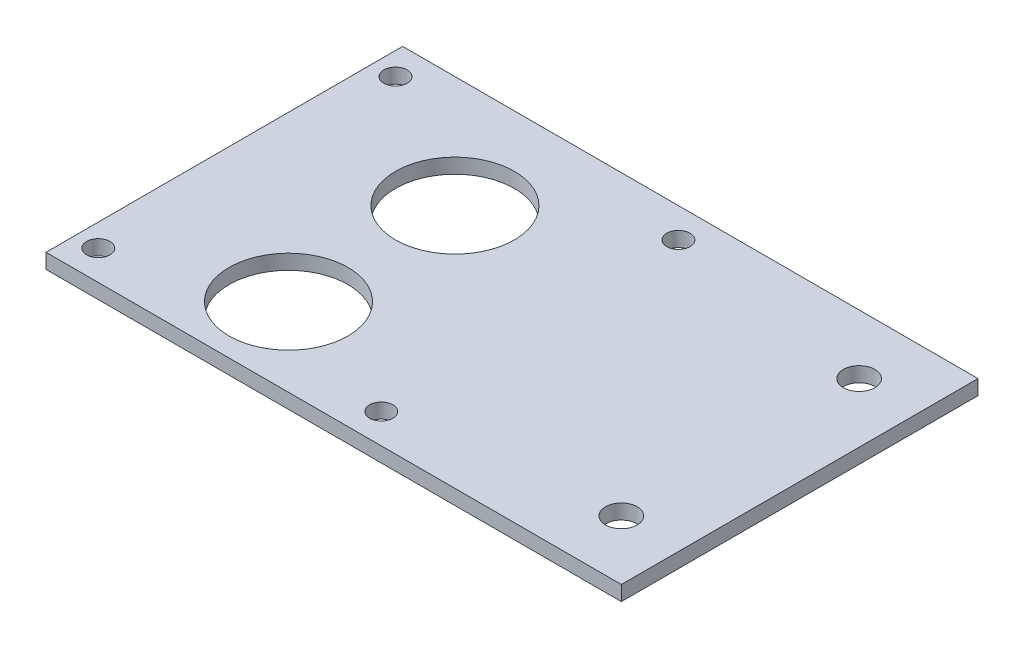
ISO-10303-21;
HEADER;
FILE_DESCRIPTION(('STEP AP214'),'2;1');
FILE_NAME('part.step','',(''),(''),'','','');
FILE_SCHEMA(('AUTOMOTIVE_DESIGN { 1 0 10303 214 1 1 1 1 }'));
ENDSEC;
DATA;
#1=APPLICATION_CONTEXT('core data for automotive mechanical design processes');
#2=APPLICATION_PROTOCOL_DEFINITION('international standard','automotive_design',2000,#1);
#3=PRODUCT_CONTEXT('',#1,'mechanical');
#4=PRODUCT('Part','Part','',(#3));
#5=PRODUCT_RELATED_PRODUCT_CATEGORY('part','',(#4));
#6=PRODUCT_DEFINITION_FORMATION('','',#4);
#7=PRODUCT_DEFINITION_CONTEXT('part definition',#1,'design');
#8=PRODUCT_DEFINITION('design','',#6,#7);
#9=PRODUCT_DEFINITION_SHAPE('','',#8);
#10=(LENGTH_UNIT() NAMED_UNIT(*) SI_UNIT(.MILLI.,.METRE.));
#11=(NAMED_UNIT(*) PLANE_ANGLE_UNIT() SI_UNIT($,.RADIAN.));
#12=(NAMED_UNIT(*) SI_UNIT($,.STERADIAN.) SOLID_ANGLE_UNIT());
#13=UNCERTAINTY_MEASURE_WITH_UNIT(LENGTH_MEASURE(1.E-05),#10,'distance_accuracy_value','');
#14=(GEOMETRIC_REPRESENTATION_CONTEXT(3) GLOBAL_UNCERTAINTY_ASSIGNED_CONTEXT((#13)) GLOBAL_UNIT_ASSIGNED_CONTEXT((#10,
#11,#12)) REPRESENTATION_CONTEXT('',''));
#15=CARTESIAN_POINT('',(0.,0.,0.));
#16=DIRECTION('',(0.,0.,1.));
#17=DIRECTION('',(1.,0.,0.));
#18=AXIS2_PLACEMENT_3D('',#15,#16,#17);
#19=CARTESIAN_POINT('',(122.936,3.175,-76.2));
#20=DIRECTION('',(0.,0.,1.));
#21=DIRECTION('',(1.,0.,0.));
#22=AXIS2_PLACEMENT_3D('',#19,#20,#21);
#23=PLANE('',#22);
#24=DIRECTION('',(-1.,0.,0.));
#25=VECTOR('',#24,1.);
#26=CARTESIAN_POINT('',(122.936,0.,-76.2));
#27=LINE('',#26,#25);
#28=CARTESIAN_POINT('',(122.936,0.,-76.2));
#29=VERTEX_POINT('',#28);
#30=CARTESIAN_POINT('',(0.,0.,-76.2));
#31=VERTEX_POINT('',#30);
#32=EDGE_CURVE('E97',#29,#31,#27,.T.);
#33=ORIENTED_EDGE('',*,*,#32,.T.);
#34=DIRECTION('',(0.,-1.,0.));
#35=VECTOR('',#34,1.);
#36=CARTESIAN_POINT('',(0.,3.175,-76.2));
#37=LINE('',#36,#35);
#38=CARTESIAN_POINT('',(0.,3.175,-76.2));
#39=VERTEX_POINT('',#38);
#40=EDGE_CURVE('E11',#39,#31,#37,.T.);
#41=ORIENTED_EDGE('',*,*,#40,.F.);
#42=DIRECTION('',(-1.,0.,0.));
#43=VECTOR('',#42,1.);
#44=CARTESIAN_POINT('',(122.936,3.175,-76.2));
#45=LINE('',#44,#43);
#46=CARTESIAN_POINT('',(122.936,3.175,-76.2));
#47=VERTEX_POINT('',#46);
#48=EDGE_CURVE('E85',#47,#39,#45,.T.);
#49=ORIENTED_EDGE('',*,*,#48,.F.);
#50=DIRECTION('',(0.,-1.,0.));
#51=VECTOR('',#50,1.);
#52=CARTESIAN_POINT('',(122.936,3.175,-76.2));
#53=LINE('',#52,#51);
#54=EDGE_CURVE('E93',#47,#29,#53,.T.);
#55=ORIENTED_EDGE('',*,*,#54,.T.);
#56=EDGE_LOOP('',(#33,#41,#49,#55));
#57=FACE_BOUND('',#56,.T.);
#58=ADVANCED_FACE('F34',(#57),#23,.F.);
#59=CARTESIAN_POINT('',(0.,3.175,-76.2));
#60=DIRECTION('',(1.,0.,0.));
#61=DIRECTION('',(0.,0.,-1.));
#62=AXIS2_PLACEMENT_3D('',#59,#60,#61);
#63=PLANE('',#62);
#64=DIRECTION('',(0.,0.,1.));
#65=VECTOR('',#64,1.);
#66=CARTESIAN_POINT('',(0.,0.,-76.2));
#67=LINE('',#66,#65);
#68=CARTESIAN_POINT('',(0.,0.,0.));
#69=VERTEX_POINT('',#68);
#70=EDGE_CURVE('E89',#31,#69,#67,.T.);
#71=ORIENTED_EDGE('',*,*,#70,.T.);
#72=DIRECTION('',(0.,-1.,0.));
#73=VECTOR('',#72,1.);
#74=CARTESIAN_POINT('',(0.,3.175,0.));
#75=LINE('',#74,#73);
#76=CARTESIAN_POINT('',(0.,3.175,0.));
#77=VERTEX_POINT('',#76);
#78=EDGE_CURVE('E42',#77,#69,#75,.T.);
#79=ORIENTED_EDGE('',*,*,#78,.F.);
#80=DIRECTION('',(0.,0.,1.));
#81=VECTOR('',#80,1.);
#82=CARTESIAN_POINT('',(0.,3.175,-76.2));
#83=LINE('',#82,#81);
#84=EDGE_CURVE('E80',#39,#77,#83,.T.);
#85=ORIENTED_EDGE('',*,*,#84,.F.);
#86=ORIENTED_EDGE('',*,*,#40,.T.);
#87=EDGE_LOOP('',(#71,#79,#85,#86));
#88=FACE_BOUND('',#87,.T.);
#89=ADVANCED_FACE('F88',(#88),#63,.F.);
#90=CARTESIAN_POINT('',(0.,3.175,0.));
#91=DIRECTION('',(0.,0.,-1.));
#92=DIRECTION('',(-1.,0.,0.));
#93=AXIS2_PLACEMENT_3D('',#90,#91,#92);
#94=PLANE('',#93);
#95=DIRECTION('',(1.,0.,0.));
#96=VECTOR('',#95,1.);
#97=CARTESIAN_POINT('',(0.,0.,0.));
#98=LINE('',#97,#96);
#99=CARTESIAN_POINT('',(122.936,0.,0.));
#100=VERTEX_POINT('',#99);
#101=EDGE_CURVE('E67',#69,#100,#98,.T.);
#102=ORIENTED_EDGE('',*,*,#101,.T.);
#103=DIRECTION('',(0.,-1.,0.));
#104=VECTOR('',#103,1.);
#105=CARTESIAN_POINT('',(122.936,3.175,0.));
#106=LINE('',#105,#104);
#107=CARTESIAN_POINT('',(122.936,3.175,0.));
#108=VERTEX_POINT('',#107);
#109=EDGE_CURVE('E90',#108,#100,#106,.T.);
#110=ORIENTED_EDGE('',*,*,#109,.F.);
#111=DIRECTION('',(1.,0.,0.));
#112=VECTOR('',#111,1.);
#113=CARTESIAN_POINT('',(0.,3.175,0.));
#114=LINE('',#113,#112);
#115=EDGE_CURVE('E83',#77,#108,#114,.T.);
#116=ORIENTED_EDGE('',*,*,#115,.F.);
#117=ORIENTED_EDGE('',*,*,#78,.T.);
#118=EDGE_LOOP('',(#102,#110,#116,#117));
#119=FACE_BOUND('',#118,.T.);
#120=ADVANCED_FACE('F91',(#119),#94,.F.);
#121=CARTESIAN_POINT('',(122.936,3.175,0.));
#122=DIRECTION('',(-1.,0.,0.));
#123=DIRECTION('',(0.,0.,1.));
#124=AXIS2_PLACEMENT_3D('',#121,#122,#123);
#125=PLANE('',#124);
#126=DIRECTION('',(0.,0.,-1.));
#127=VECTOR('',#126,1.);
#128=CARTESIAN_POINT('',(122.936,0.,0.));
#129=LINE('',#128,#127);
#130=EDGE_CURVE('E73',#100,#29,#129,.T.);
#131=ORIENTED_EDGE('',*,*,#130,.T.);
#132=ORIENTED_EDGE('',*,*,#54,.F.);
#133=DIRECTION('',(0.,0.,-1.));
#134=VECTOR('',#133,1.);
#135=CARTESIAN_POINT('',(122.936,3.175,0.));
#136=LINE('',#135,#134);
#137=EDGE_CURVE('E50',#108,#47,#136,.T.);
#138=ORIENTED_EDGE('',*,*,#137,.F.);
#139=ORIENTED_EDGE('',*,*,#109,.T.);
#140=EDGE_LOOP('',(#131,#132,#138,#139));
#141=FACE_BOUND('',#140,.T.);
#142=ADVANCED_FACE('F105',(#141),#125,.F.);
#143=CARTESIAN_POINT('',(0.,3.175,0.));
#144=DIRECTION('',(0.,1.,0.));
#145=DIRECTION('',(0.,0.,1.));
#146=AXIS2_PLACEMENT_3D('',#143,#144,#145);
#147=PLANE('',#146);
#148=CARTESIAN_POINT('',(35.052,3.175,-16.764));
#149=DIRECTION('',(0.,1.,0.));
#150=DIRECTION('',(0.,0.,1.));
#151=AXIS2_PLACEMENT_3D('',#148,#149,#150);
#152=CIRCLE('',#151,12.7);
#153=CARTESIAN_POINT('',(35.052,3.175,-4.064));
#154=VERTEX_POINT('',#153);
#155=EDGE_CURVE('E153',#154,#154,#152,.T.);
#156=ORIENTED_EDGE('',*,*,#155,.F.);
#157=EDGE_LOOP('',(#156));
#158=FACE_BOUND('',#157,.T.);
#159=CARTESIAN_POINT('',(35.052,3.175,-52.324));
#160=DIRECTION('',(0.,1.,0.));
#161=DIRECTION('',(0.,0.,1.));
#162=AXIS2_PLACEMENT_3D('',#159,#160,#161);
#163=CIRCLE('',#162,12.7);
#164=CARTESIAN_POINT('',(35.052,3.175,-39.624));
#165=VERTEX_POINT('',#164);
#166=EDGE_CURVE('E147',#165,#165,#163,.T.);
#167=ORIENTED_EDGE('',*,*,#166,.F.);
#168=EDGE_LOOP('',(#167));
#169=FACE_BOUND('',#168,.T.);
#170=CARTESIAN_POINT('',(110.236,3.175,-12.6999999999999));
#171=DIRECTION('',(0.,1.,0.));
#172=DIRECTION('',(0.,0.,1.));
#173=AXIS2_PLACEMENT_3D('',#170,#171,#172);
#174=CIRCLE('',#173,3.3782);
#175=CARTESIAN_POINT('',(110.236,3.175,-9.32179999999989));
#176=VERTEX_POINT('',#175);
#177=EDGE_CURVE('E143',#176,#176,#174,.T.);
#178=ORIENTED_EDGE('',*,*,#177,.F.);
#179=EDGE_LOOP('',(#178));
#180=FACE_BOUND('',#179,.T.);
#181=CARTESIAN_POINT('',(65.278,3.175,-6.34999999999994));
#182=DIRECTION('',(0.,1.,0.));
#183=DIRECTION('',(0.,0.,1.));
#184=AXIS2_PLACEMENT_3D('',#181,#182,#183);
#185=CIRCLE('',#184,2.4892);
#186=CARTESIAN_POINT('',(65.278,3.175,-3.86079999999994));
#187=VERTEX_POINT('',#186);
#188=EDGE_CURVE('E137',#187,#187,#185,.T.);
#189=ORIENTED_EDGE('',*,*,#188,.F.);
#190=EDGE_LOOP('',(#189));
#191=FACE_BOUND('',#190,.T.);
#192=CARTESIAN_POINT('',(4.82599999999996,3.175,-6.35000000000001));
#193=DIRECTION('',(0.,1.,0.));
#194=DIRECTION('',(0.,0.,1.));
#195=AXIS2_PLACEMENT_3D('',#192,#193,#194);
#196=CIRCLE('',#195,2.4892);
#197=CARTESIAN_POINT('',(4.82599999999996,3.175,-3.86080000000001));
#198=VERTEX_POINT('',#197);
#199=EDGE_CURVE('E131',#198,#198,#196,.T.);
#200=ORIENTED_EDGE('',*,*,#199,.F.);
#201=EDGE_LOOP('',(#200));
#202=FACE_BOUND('',#201,.T.);
#203=CARTESIAN_POINT('',(110.236,3.175,-63.5));
#204=DIRECTION('',(0.,1.,0.));
#205=DIRECTION('',(0.,0.,1.));
#206=AXIS2_PLACEMENT_3D('',#203,#204,#205);
#207=CIRCLE('',#206,3.3782);
#208=CARTESIAN_POINT('',(110.236,3.175,-60.1218));
#209=VERTEX_POINT('',#208);
#210=EDGE_CURVE('E125',#209,#209,#207,.T.);
#211=ORIENTED_EDGE('',*,*,#210,.F.);
#212=EDGE_LOOP('',(#211));
#213=FACE_BOUND('',#212,.T.);
#214=CARTESIAN_POINT('',(65.278,3.175,-69.85));
#215=DIRECTION('',(0.,1.,0.));
#216=DIRECTION('',(0.,0.,1.));
#217=AXIS2_PLACEMENT_3D('',#214,#215,#216);
#218=CIRCLE('',#217,2.4892);
#219=CARTESIAN_POINT('',(65.278,3.175,-67.3608));
#220=VERTEX_POINT('',#219);
#221=EDGE_CURVE('E116',#220,#220,#218,.T.);
#222=ORIENTED_EDGE('',*,*,#221,.F.);
#223=EDGE_LOOP('',(#222));
#224=FACE_BOUND('',#223,.T.);
#225=CARTESIAN_POINT('',(4.826,3.175,-69.85));
#226=DIRECTION('',(0.,1.,0.));
#227=DIRECTION('',(0.,0.,1.));
#228=AXIS2_PLACEMENT_3D('',#225,#226,#227);
#229=CIRCLE('',#228,2.4892);
#230=CARTESIAN_POINT('',(4.826,3.175,-67.3608));
#231=VERTEX_POINT('',#230);
#232=EDGE_CURVE('E113',#231,#231,#229,.T.);
#233=ORIENTED_EDGE('',*,*,#232,.F.);
#234=EDGE_LOOP('',(#233));
#235=FACE_BOUND('',#234,.T.);
#236=ORIENTED_EDGE('',*,*,#48,.T.);
#237=ORIENTED_EDGE('',*,*,#84,.T.);
#238=ORIENTED_EDGE('',*,*,#115,.T.);
#239=ORIENTED_EDGE('',*,*,#137,.T.);
#240=EDGE_LOOP('',(#236,#237,#238,#239));
#241=FACE_BOUND('',#240,.T.);
#242=ADVANCED_FACE('F81',(#158,#169,#180,#191,#202,#213,#224,#235,#241),#147,.T.);
#243=CARTESIAN_POINT('',(0.,0.,0.));
#244=DIRECTION('',(0.,1.,0.));
#245=DIRECTION('',(0.,0.,1.));
#246=AXIS2_PLACEMENT_3D('',#243,#244,#245);
#247=PLANE('',#246);
#248=CARTESIAN_POINT('',(35.052,0.,-16.764));
#249=DIRECTION('',(0.,1.,0.));
#250=DIRECTION('',(0.,0.,1.));
#251=AXIS2_PLACEMENT_3D('',#248,#249,#250);
#252=CIRCLE('',#251,12.7);
#253=CARTESIAN_POINT('',(35.052,0.,-4.064));
#254=VERTEX_POINT('',#253);
#255=EDGE_CURVE('E146',#254,#254,#252,.T.);
#256=ORIENTED_EDGE('',*,*,#255,.T.);
#257=EDGE_LOOP('',(#256));
#258=FACE_BOUND('',#257,.T.);
#259=CARTESIAN_POINT('',(35.052,0.,-52.324));
#260=DIRECTION('',(0.,1.,0.));
#261=DIRECTION('',(0.,0.,1.));
#262=AXIS2_PLACEMENT_3D('',#259,#260,#261);
#263=CIRCLE('',#262,12.7);
#264=CARTESIAN_POINT('',(35.052,0.,-39.624));
#265=VERTEX_POINT('',#264);
#266=EDGE_CURVE('E150',#265,#265,#263,.T.);
#267=ORIENTED_EDGE('',*,*,#266,.T.);
#268=EDGE_LOOP('',(#267));
#269=FACE_BOUND('',#268,.T.);
#270=CARTESIAN_POINT('',(110.236,0.,-12.6999999999999));
#271=DIRECTION('',(0.,1.,0.));
#272=DIRECTION('',(0.,0.,1.));
#273=AXIS2_PLACEMENT_3D('',#270,#271,#272);
#274=CIRCLE('',#273,3.3782);
#275=CARTESIAN_POINT('',(110.236,0.,-9.32179999999989));
#276=VERTEX_POINT('',#275);
#277=EDGE_CURVE('E140',#276,#276,#274,.T.);
#278=ORIENTED_EDGE('',*,*,#277,.T.);
#279=EDGE_LOOP('',(#278));
#280=FACE_BOUND('',#279,.T.);
#281=CARTESIAN_POINT('',(65.278,0.,-6.34999999999994));
#282=DIRECTION('',(0.,1.,0.));
#283=DIRECTION('',(0.,0.,1.));
#284=AXIS2_PLACEMENT_3D('',#281,#282,#283);
#285=CIRCLE('',#284,2.4892);
#286=CARTESIAN_POINT('',(65.278,0.,-3.86079999999994));
#287=VERTEX_POINT('',#286);
#288=EDGE_CURVE('E134',#287,#287,#285,.T.);
#289=ORIENTED_EDGE('',*,*,#288,.T.);
#290=EDGE_LOOP('',(#289));
#291=FACE_BOUND('',#290,.T.);
#292=CARTESIAN_POINT('',(4.82599999999996,0.,-6.35000000000001));
#293=DIRECTION('',(0.,1.,0.));
#294=DIRECTION('',(0.,0.,1.));
#295=AXIS2_PLACEMENT_3D('',#292,#293,#294);
#296=CIRCLE('',#295,2.4892);
#297=CARTESIAN_POINT('',(4.82599999999996,0.,-3.86080000000001));
#298=VERTEX_POINT('',#297);
#299=EDGE_CURVE('E128',#298,#298,#296,.T.);
#300=ORIENTED_EDGE('',*,*,#299,.T.);
#301=EDGE_LOOP('',(#300));
#302=FACE_BOUND('',#301,.T.);
#303=CARTESIAN_POINT('',(110.236,0.,-63.5));
#304=DIRECTION('',(0.,1.,0.));
#305=DIRECTION('',(0.,0.,1.));
#306=AXIS2_PLACEMENT_3D('',#303,#304,#305);
#307=CIRCLE('',#306,3.3782);
#308=CARTESIAN_POINT('',(110.236,0.,-60.1218));
#309=VERTEX_POINT('',#308);
#310=EDGE_CURVE('E122',#309,#309,#307,.T.);
#311=ORIENTED_EDGE('',*,*,#310,.T.);
#312=EDGE_LOOP('',(#311));
#313=FACE_BOUND('',#312,.T.);
#314=CARTESIAN_POINT('',(65.278,0.,-69.85));
#315=DIRECTION('',(0.,1.,0.));
#316=DIRECTION('',(0.,0.,1.));
#317=AXIS2_PLACEMENT_3D('',#314,#315,#316);
#318=CIRCLE('',#317,2.4892);
#319=CARTESIAN_POINT('',(65.278,0.,-67.3608));
#320=VERTEX_POINT('',#319);
#321=EDGE_CURVE('E119',#320,#320,#318,.T.);
#322=ORIENTED_EDGE('',*,*,#321,.T.);
#323=EDGE_LOOP('',(#322));
#324=FACE_BOUND('',#323,.T.);
#325=CARTESIAN_POINT('',(4.826,0.,-69.85));
#326=DIRECTION('',(0.,1.,0.));
#327=DIRECTION('',(0.,0.,1.));
#328=AXIS2_PLACEMENT_3D('',#325,#326,#327);
#329=CIRCLE('',#328,2.4892);
#330=CARTESIAN_POINT('',(4.826,0.,-67.3608));
#331=VERTEX_POINT('',#330);
#332=EDGE_CURVE('E100',#331,#331,#329,.T.);
#333=ORIENTED_EDGE('',*,*,#332,.T.);
#334=EDGE_LOOP('',(#333));
#335=FACE_BOUND('',#334,.T.);
#336=ORIENTED_EDGE('',*,*,#32,.F.);
#337=ORIENTED_EDGE('',*,*,#130,.F.);
#338=ORIENTED_EDGE('',*,*,#101,.F.);
#339=ORIENTED_EDGE('',*,*,#70,.F.);
#340=EDGE_LOOP('',(#336,#337,#338,#339));
#341=FACE_BOUND('',#340,.T.);
#342=ADVANCED_FACE('F108',(#258,#269,#280,#291,#302,#313,#324,#335,#341),#247,.F.);
#343=CARTESIAN_POINT('',(4.826,3.175,-69.85));
#344=DIRECTION('',(0.,1.,0.));
#345=DIRECTION('',(0.,0.,1.));
#346=AXIS2_PLACEMENT_3D('',#343,#344,#345);
#347=CYLINDRICAL_SURFACE('',#346,2.4892);
#348=ORIENTED_EDGE('',*,*,#332,.F.);
#349=EDGE_LOOP('',(#348));
#350=FACE_BOUND('',#349,.T.);
#351=ORIENTED_EDGE('',*,*,#232,.T.);
#352=EDGE_LOOP('',(#351));
#353=FACE_BOUND('',#352,.T.);
#354=ADVANCED_FACE('F185',(#350,#353),#347,.F.);
#355=CARTESIAN_POINT('',(65.278,3.175,-69.85));
#356=DIRECTION('',(0.,1.,0.));
#357=DIRECTION('',(0.,0.,1.));
#358=AXIS2_PLACEMENT_3D('',#355,#356,#357);
#359=CYLINDRICAL_SURFACE('',#358,2.4892);
#360=ORIENTED_EDGE('',*,*,#321,.F.);
#361=EDGE_LOOP('',(#360));
#362=FACE_BOUND('',#361,.T.);
#363=ORIENTED_EDGE('',*,*,#221,.T.);
#364=EDGE_LOOP('',(#363));
#365=FACE_BOUND('',#364,.T.);
#366=ADVANCED_FACE('F187',(#362,#365),#359,.F.);
#367=CARTESIAN_POINT('',(110.236,3.175,-63.5));
#368=DIRECTION('',(0.,1.,0.));
#369=DIRECTION('',(0.,0.,1.));
#370=AXIS2_PLACEMENT_3D('',#367,#368,#369);
#371=CYLINDRICAL_SURFACE('',#370,3.3782);
#372=ORIENTED_EDGE('',*,*,#310,.F.);
#373=EDGE_LOOP('',(#372));
#374=FACE_BOUND('',#373,.T.);
#375=ORIENTED_EDGE('',*,*,#210,.T.);
#376=EDGE_LOOP('',(#375));
#377=FACE_BOUND('',#376,.T.);
#378=ADVANCED_FACE('F194',(#374,#377),#371,.F.);
#379=CARTESIAN_POINT('',(4.82599999999996,3.175,-6.35000000000001));
#380=DIRECTION('',(0.,1.,0.));
#381=DIRECTION('',(0.,0.,1.));
#382=AXIS2_PLACEMENT_3D('',#379,#380,#381);
#383=CYLINDRICAL_SURFACE('',#382,2.4892);
#384=ORIENTED_EDGE('',*,*,#299,.F.);
#385=EDGE_LOOP('',(#384));
#386=FACE_BOUND('',#385,.T.);
#387=ORIENTED_EDGE('',*,*,#199,.T.);
#388=EDGE_LOOP('',(#387));
#389=FACE_BOUND('',#388,.T.);
#390=ADVANCED_FACE('F256',(#386,#389),#383,.F.);
#391=CARTESIAN_POINT('',(65.278,3.175,-6.34999999999994));
#392=DIRECTION('',(0.,1.,0.));
#393=DIRECTION('',(0.,0.,1.));
#394=AXIS2_PLACEMENT_3D('',#391,#392,#393);
#395=CYLINDRICAL_SURFACE('',#394,2.4892);
#396=ORIENTED_EDGE('',*,*,#288,.F.);
#397=EDGE_LOOP('',(#396));
#398=FACE_BOUND('',#397,.T.);
#399=ORIENTED_EDGE('',*,*,#188,.T.);
#400=EDGE_LOOP('',(#399));
#401=FACE_BOUND('',#400,.T.);
#402=ADVANCED_FACE('F248',(#398,#401),#395,.F.);
#403=CARTESIAN_POINT('',(110.236,3.175,-12.6999999999999));
#404=DIRECTION('',(0.,1.,0.));
#405=DIRECTION('',(0.,0.,1.));
#406=AXIS2_PLACEMENT_3D('',#403,#404,#405);
#407=CYLINDRICAL_SURFACE('',#406,3.3782);
#408=ORIENTED_EDGE('',*,*,#277,.F.);
#409=EDGE_LOOP('',(#408));
#410=FACE_BOUND('',#409,.T.);
#411=ORIENTED_EDGE('',*,*,#177,.T.);
#412=EDGE_LOOP('',(#411));
#413=FACE_BOUND('',#412,.T.);
#414=ADVANCED_FACE('F233',(#410,#413),#407,.F.);
#415=CARTESIAN_POINT('',(35.052,0.,-52.324));
#416=DIRECTION('',(0.,1.,0.));
#417=DIRECTION('',(0.,0.,1.));
#418=AXIS2_PLACEMENT_3D('',#415,#416,#417);
#419=CYLINDRICAL_SURFACE('',#418,12.7);
#420=ORIENTED_EDGE('',*,*,#266,.F.);
#421=EDGE_LOOP('',(#420));
#422=FACE_BOUND('',#421,.T.);
#423=ORIENTED_EDGE('',*,*,#166,.T.);
#424=EDGE_LOOP('',(#423));
#425=FACE_BOUND('',#424,.T.);
#426=ADVANCED_FACE('F164',(#422,#425),#419,.F.);
#427=CARTESIAN_POINT('',(35.052,0.,-16.764));
#428=DIRECTION('',(0.,1.,0.));
#429=DIRECTION('',(0.,0.,1.));
#430=AXIS2_PLACEMENT_3D('',#427,#428,#429);
#431=CYLINDRICAL_SURFACE('',#430,12.7);
#432=ORIENTED_EDGE('',*,*,#255,.F.);
#433=EDGE_LOOP('',(#432));
#434=FACE_BOUND('',#433,.T.);
#435=ORIENTED_EDGE('',*,*,#155,.T.);
#436=EDGE_LOOP('',(#435));
#437=FACE_BOUND('',#436,.T.);
#438=ADVANCED_FACE('F161',(#434,#437),#431,.F.);
#439=CLOSED_SHELL('',(#58,#89,#120,#142,#242,#342,#354,#366,#378,#390,#402,#414,#426,#438));
#440=MANIFOLD_SOLID_BREP('B2',#439);
#441=ADVANCED_BREP_SHAPE_REPRESENTATION('',(#18,#440),#14);
#442=SHAPE_DEFINITION_REPRESENTATION(#9,#441);
ENDSEC;
END-ISO-10303-21;
